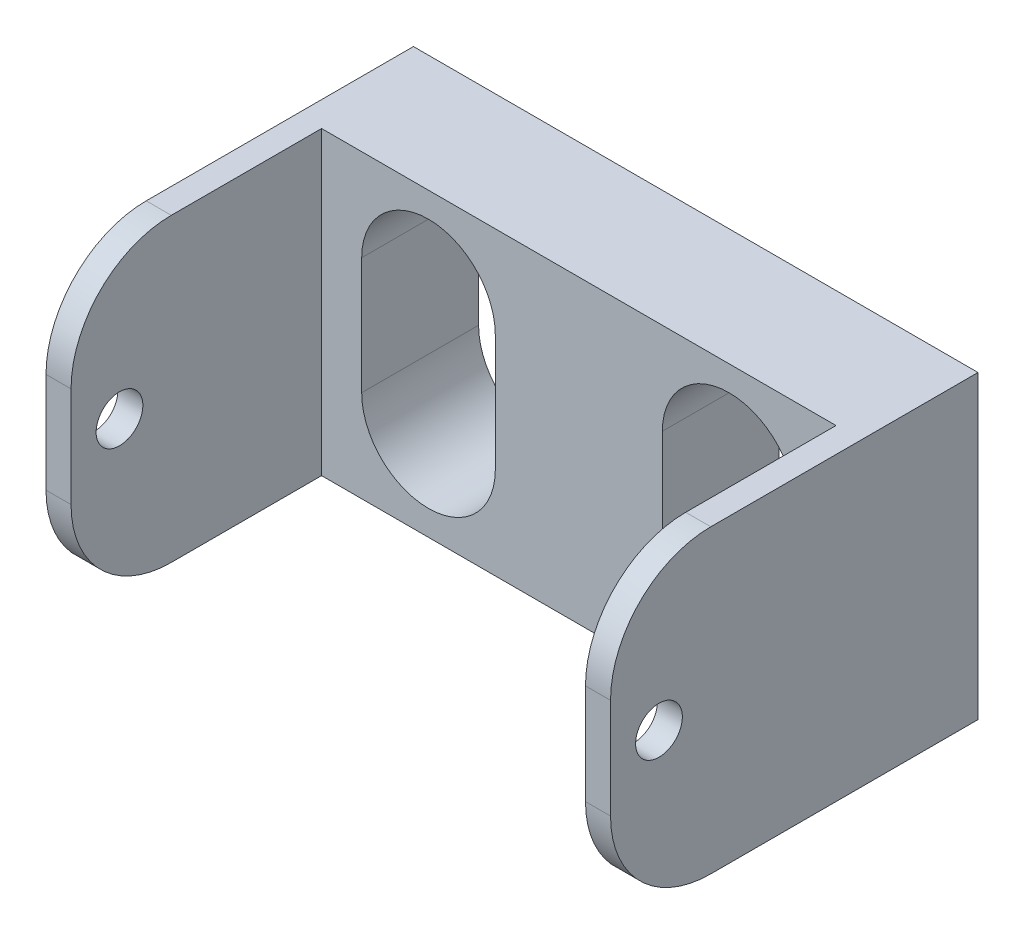
ISO-10303-21;
HEADER;
FILE_DESCRIPTION(('STEP AP214'),'2;1');
FILE_NAME('part.step','',(''),(''),'','','');
FILE_SCHEMA(('AUTOMOTIVE_DESIGN { 1 0 10303 214 1 1 1 1 }'));
ENDSEC;
DATA;
#1=APPLICATION_CONTEXT('core data for automotive mechanical design processes');
#2=APPLICATION_PROTOCOL_DEFINITION('international standard','automotive_design',2000,#1);
#3=PRODUCT_CONTEXT('',#1,'mechanical');
#4=PRODUCT('Part','Part','',(#3));
#5=PRODUCT_RELATED_PRODUCT_CATEGORY('part','',(#4));
#6=PRODUCT_DEFINITION_FORMATION('','',#4);
#7=PRODUCT_DEFINITION_CONTEXT('part definition',#1,'design');
#8=PRODUCT_DEFINITION('design','',#6,#7);
#9=PRODUCT_DEFINITION_SHAPE('','',#8);
#10=(LENGTH_UNIT() NAMED_UNIT(*) SI_UNIT(.MILLI.,.METRE.));
#11=(NAMED_UNIT(*) PLANE_ANGLE_UNIT() SI_UNIT($,.RADIAN.));
#12=(NAMED_UNIT(*) SI_UNIT($,.STERADIAN.) SOLID_ANGLE_UNIT());
#13=UNCERTAINTY_MEASURE_WITH_UNIT(LENGTH_MEASURE(1.E-05),#10,'distance_accuracy_value','');
#14=(GEOMETRIC_REPRESENTATION_CONTEXT(3) GLOBAL_UNCERTAINTY_ASSIGNED_CONTEXT((#13)) GLOBAL_UNIT_ASSIGNED_CONTEXT((#10,
#11,#12)) REPRESENTATION_CONTEXT('',''));
#15=CARTESIAN_POINT('',(0.,0.,0.));
#16=DIRECTION('',(0.,0.,1.));
#17=DIRECTION('',(1.,0.,0.));
#18=AXIS2_PLACEMENT_3D('',#15,#16,#17);
#19=CARTESIAN_POINT('',(0.,0.,7.));
#20=DIRECTION('',(0.,0.,-1.));
#21=DIRECTION('',(-1.,0.,0.));
#22=AXIS2_PLACEMENT_3D('',#19,#20,#21);
#23=PLANE('',#22);
#24=CARTESIAN_POINT('',(-9.,3.5,7.));
#25=DIRECTION('',(0.,0.,1.));
#26=DIRECTION('',(1.,0.,0.));
#27=AXIS2_PLACEMENT_3D('',#24,#25,#26);
#28=CIRCLE('',#27,4.);
#29=CARTESIAN_POINT('',(-5.,3.5,7.));
#30=VERTEX_POINT('',#29);
#31=CARTESIAN_POINT('',(-13.,3.5,7.));
#32=VERTEX_POINT('',#31);
#33=EDGE_CURVE('E242',#30,#32,#28,.T.);
#34=ORIENTED_EDGE('',*,*,#33,.F.);
#35=DIRECTION('',(0.,1.,0.));
#36=VECTOR('',#35,1.);
#37=CARTESIAN_POINT('',(-5.,3.5,7.));
#38=LINE('',#37,#36);
#39=CARTESIAN_POINT('',(-5.,-3.5,7.));
#40=VERTEX_POINT('',#39);
#41=EDGE_CURVE('E250',#40,#30,#38,.T.);
#42=ORIENTED_EDGE('',*,*,#41,.F.);
#43=CARTESIAN_POINT('',(-9.,-3.5,7.));
#44=DIRECTION('',(0.,0.,1.));
#45=DIRECTION('',(1.,0.,0.));
#46=AXIS2_PLACEMENT_3D('',#43,#44,#45);
#47=CIRCLE('',#46,4.);
#48=CARTESIAN_POINT('',(-13.,-3.5,7.));
#49=VERTEX_POINT('',#48);
#50=EDGE_CURVE('E247',#49,#40,#47,.T.);
#51=ORIENTED_EDGE('',*,*,#50,.F.);
#52=DIRECTION('',(0.,-1.,0.));
#53=VECTOR('',#52,1.);
#54=CARTESIAN_POINT('',(-13.,3.5,7.));
#55=LINE('',#54,#53);
#56=EDGE_CURVE('E244',#32,#49,#55,.T.);
#57=ORIENTED_EDGE('',*,*,#56,.F.);
#58=EDGE_LOOP('',(#34,#42,#51,#57));
#59=FACE_BOUND('',#58,.T.);
#60=CARTESIAN_POINT('',(9.,3.5,7.));
#61=DIRECTION('',(0.,0.,1.));
#62=DIRECTION('',(1.,0.,0.));
#63=AXIS2_PLACEMENT_3D('',#60,#61,#62);
#64=CIRCLE('',#63,4.);
#65=CARTESIAN_POINT('',(13.,3.5,7.));
#66=VERTEX_POINT('',#65);
#67=CARTESIAN_POINT('',(5.,3.5,7.));
#68=VERTEX_POINT('',#67);
#69=EDGE_CURVE('E210',#66,#68,#64,.T.);
#70=ORIENTED_EDGE('',*,*,#69,.F.);
#71=DIRECTION('',(0.,1.,0.));
#72=VECTOR('',#71,1.);
#73=CARTESIAN_POINT('',(13.,3.5,7.));
#74=LINE('',#73,#72);
#75=CARTESIAN_POINT('',(13.,-3.5,7.));
#76=VERTEX_POINT('',#75);
#77=EDGE_CURVE('E218',#76,#66,#74,.T.);
#78=ORIENTED_EDGE('',*,*,#77,.F.);
#79=CARTESIAN_POINT('',(9.,-3.5,7.));
#80=DIRECTION('',(0.,0.,1.));
#81=DIRECTION('',(1.,0.,0.));
#82=AXIS2_PLACEMENT_3D('',#79,#80,#81);
#83=CIRCLE('',#82,4.);
#84=CARTESIAN_POINT('',(5.,-3.5,7.));
#85=VERTEX_POINT('',#84);
#86=EDGE_CURVE('E215',#85,#76,#83,.T.);
#87=ORIENTED_EDGE('',*,*,#86,.F.);
#88=DIRECTION('',(0.,-1.,0.));
#89=VECTOR('',#88,1.);
#90=CARTESIAN_POINT('',(5.,3.5,7.));
#91=LINE('',#90,#89);
#92=EDGE_CURVE('E212',#68,#85,#91,.T.);
#93=ORIENTED_EDGE('',*,*,#92,.F.);
#94=EDGE_LOOP('',(#70,#78,#87,#93));
#95=FACE_BOUND('',#94,.T.);
#96=DIRECTION('',(0.,-1.,0.));
#97=VECTOR('',#96,1.);
#98=CARTESIAN_POINT('',(15.4,9.,7.));
#99=LINE('',#98,#97);
#100=CARTESIAN_POINT('',(15.4,9.,7.));
#101=VERTEX_POINT('',#100);
#102=CARTESIAN_POINT('',(15.4,-9.,7.));
#103=VERTEX_POINT('',#102);
#104=EDGE_CURVE('E186',#101,#103,#99,.T.);
#105=ORIENTED_EDGE('',*,*,#104,.F.);
#106=DIRECTION('',(-1.,0.,0.));
#107=VECTOR('',#106,1.);
#108=CARTESIAN_POINT('',(-16.9,9.,7.));
#109=LINE('',#108,#107);
#110=CARTESIAN_POINT('',(-15.4,9.,7.));
#111=VERTEX_POINT('',#110);
#112=EDGE_CURVE('E172',#101,#111,#109,.T.);
#113=ORIENTED_EDGE('',*,*,#112,.T.);
#114=DIRECTION('',(0.,1.,0.));
#115=VECTOR('',#114,1.);
#116=CARTESIAN_POINT('',(-15.4,9.,7.));
#117=LINE('',#116,#115);
#118=CARTESIAN_POINT('',(-15.4,-9.,7.));
#119=VERTEX_POINT('',#118);
#120=EDGE_CURVE('E183',#119,#111,#117,.T.);
#121=ORIENTED_EDGE('',*,*,#120,.F.);
#122=DIRECTION('',(1.,0.,0.));
#123=VECTOR('',#122,1.);
#124=CARTESIAN_POINT('',(-16.9,-9.,7.));
#125=LINE('',#124,#123);
#126=EDGE_CURVE('E187',#119,#103,#125,.T.);
#127=ORIENTED_EDGE('',*,*,#126,.T.);
#128=EDGE_LOOP('',(#105,#113,#121,#127));
#129=FACE_BOUND('',#128,.T.);
#130=ADVANCED_FACE('F35',(#59,#95,#129),#23,.F.);
#131=CARTESIAN_POINT('',(0.,0.,0.));
#132=DIRECTION('',(0.,0.,-1.));
#133=DIRECTION('',(-1.,0.,0.));
#134=AXIS2_PLACEMENT_3D('',#131,#132,#133);
#135=PLANE('',#134);
#136=DIRECTION('',(0.,1.,0.));
#137=VECTOR('',#136,1.);
#138=CARTESIAN_POINT('',(-5.,3.5,0.));
#139=LINE('',#138,#137);
#140=CARTESIAN_POINT('',(-5.,-3.5,0.));
#141=VERTEX_POINT('',#140);
#142=CARTESIAN_POINT('',(-5.,3.5,0.));
#143=VERTEX_POINT('',#142);
#144=EDGE_CURVE('E245',#141,#143,#139,.T.);
#145=ORIENTED_EDGE('',*,*,#144,.T.);
#146=CARTESIAN_POINT('',(-9.,3.5,0.));
#147=DIRECTION('',(0.,0.,1.));
#148=DIRECTION('',(1.,0.,0.));
#149=AXIS2_PLACEMENT_3D('',#146,#147,#148);
#150=CIRCLE('',#149,4.);
#151=CARTESIAN_POINT('',(-13.,3.5,0.));
#152=VERTEX_POINT('',#151);
#153=EDGE_CURVE('E241',#143,#152,#150,.T.);
#154=ORIENTED_EDGE('',*,*,#153,.T.);
#155=DIRECTION('',(0.,-1.,0.));
#156=VECTOR('',#155,1.);
#157=CARTESIAN_POINT('',(-13.,3.5,0.));
#158=LINE('',#157,#156);
#159=CARTESIAN_POINT('',(-13.,-3.5,0.));
#160=VERTEX_POINT('',#159);
#161=EDGE_CURVE('E255',#152,#160,#158,.T.);
#162=ORIENTED_EDGE('',*,*,#161,.T.);
#163=CARTESIAN_POINT('',(-9.,-3.5,0.));
#164=DIRECTION('',(0.,0.,1.));
#165=DIRECTION('',(1.,0.,0.));
#166=AXIS2_PLACEMENT_3D('',#163,#164,#165);
#167=CIRCLE('',#166,4.);
#168=EDGE_CURVE('E258',#160,#141,#167,.T.);
#169=ORIENTED_EDGE('',*,*,#168,.T.);
#170=EDGE_LOOP('',(#145,#154,#162,#169));
#171=FACE_BOUND('',#170,.T.);
#172=DIRECTION('',(0.,1.,0.));
#173=VECTOR('',#172,1.);
#174=CARTESIAN_POINT('',(16.9,-9.,0.));
#175=LINE('',#174,#173);
#176=CARTESIAN_POINT('',(16.9,-9.,0.));
#177=VERTEX_POINT('',#176);
#178=CARTESIAN_POINT('',(16.9,9.,0.));
#179=VERTEX_POINT('',#178);
#180=EDGE_CURVE('E272',#177,#179,#175,.T.);
#181=ORIENTED_EDGE('',*,*,#180,.F.);
#182=DIRECTION('',(1.,0.,0.));
#183=VECTOR('',#182,1.);
#184=CARTESIAN_POINT('',(-16.9,-9.,0.));
#185=LINE('',#184,#183);
#186=CARTESIAN_POINT('',(-16.9,-9.,0.));
#187=VERTEX_POINT('',#186);
#188=EDGE_CURVE('E188',#187,#177,#185,.T.);
#189=ORIENTED_EDGE('',*,*,#188,.F.);
#190=DIRECTION('',(0.,-1.,0.));
#191=VECTOR('',#190,1.);
#192=CARTESIAN_POINT('',(-16.9,-9.,0.));
#193=LINE('',#192,#191);
#194=CARTESIAN_POINT('',(-16.9,9.,0.));
#195=VERTEX_POINT('',#194);
#196=EDGE_CURVE('E425',#195,#187,#193,.T.);
#197=ORIENTED_EDGE('',*,*,#196,.F.);
#198=DIRECTION('',(-1.,0.,0.));
#199=VECTOR('',#198,1.);
#200=CARTESIAN_POINT('',(-16.9,9.,0.));
#201=LINE('',#200,#199);
#202=EDGE_CURVE('E427',#179,#195,#201,.T.);
#203=ORIENTED_EDGE('',*,*,#202,.F.);
#204=EDGE_LOOP('',(#181,#189,#197,#203));
#205=FACE_BOUND('',#204,.T.);
#206=DIRECTION('',(0.,1.,0.));
#207=VECTOR('',#206,1.);
#208=CARTESIAN_POINT('',(13.,3.5,0.));
#209=LINE('',#208,#207);
#210=CARTESIAN_POINT('',(13.,-3.5,0.));
#211=VERTEX_POINT('',#210);
#212=CARTESIAN_POINT('',(13.,3.5,0.));
#213=VERTEX_POINT('',#212);
#214=EDGE_CURVE('E213',#211,#213,#209,.T.);
#215=ORIENTED_EDGE('',*,*,#214,.T.);
#216=CARTESIAN_POINT('',(9.,3.5,0.));
#217=DIRECTION('',(0.,0.,1.));
#218=DIRECTION('',(1.,0.,0.));
#219=AXIS2_PLACEMENT_3D('',#216,#217,#218);
#220=CIRCLE('',#219,4.);
#221=CARTESIAN_POINT('',(5.,3.5,0.));
#222=VERTEX_POINT('',#221);
#223=EDGE_CURVE('E221',#213,#222,#220,.T.);
#224=ORIENTED_EDGE('',*,*,#223,.T.);
#225=DIRECTION('',(0.,-1.,0.));
#226=VECTOR('',#225,1.);
#227=CARTESIAN_POINT('',(5.,3.5,0.));
#228=LINE('',#227,#226);
#229=CARTESIAN_POINT('',(5.,-3.5,0.));
#230=VERTEX_POINT('',#229);
#231=EDGE_CURVE('E224',#222,#230,#228,.T.);
#232=ORIENTED_EDGE('',*,*,#231,.T.);
#233=CARTESIAN_POINT('',(9.,-3.5,0.));
#234=DIRECTION('',(0.,0.,1.));
#235=DIRECTION('',(1.,0.,0.));
#236=AXIS2_PLACEMENT_3D('',#233,#234,#235);
#237=CIRCLE('',#236,4.);
#238=EDGE_CURVE('E227',#230,#211,#237,.T.);
#239=ORIENTED_EDGE('',*,*,#238,.T.);
#240=EDGE_LOOP('',(#215,#224,#232,#239));
#241=FACE_BOUND('',#240,.T.);
#242=ADVANCED_FACE('F373',(#171,#205,#241),#135,.T.);
#243=CARTESIAN_POINT('',(16.9,-9.,7.));
#244=DIRECTION('',(-1.,0.,0.));
#245=DIRECTION('',(0.,0.,1.));
#246=AXIS2_PLACEMENT_3D('',#243,#244,#245);
#247=PLANE('',#246);
#248=CARTESIAN_POINT('',(16.9,0.,19.1));
#249=DIRECTION('',(1.,0.,0.));
#250=DIRECTION('',(0.,0.,-1.));
#251=AXIS2_PLACEMENT_3D('',#248,#249,#250);
#252=CIRCLE('',#251,1.4);
#253=CARTESIAN_POINT('',(16.9,0.,17.7));
#254=VERTEX_POINT('',#253);
#255=EDGE_CURVE('E349',#254,#254,#252,.T.);
#256=ORIENTED_EDGE('',*,*,#255,.F.);
#257=EDGE_LOOP('',(#256));
#258=FACE_BOUND('',#257,.T.);
#259=DIRECTION('',(0.,1.,0.));
#260=VECTOR('',#259,1.);
#261=CARTESIAN_POINT('',(16.9,9.,22.));
#262=LINE('',#261,#260);
#263=CARTESIAN_POINT('',(16.9,-3.,22.));
#264=VERTEX_POINT('',#263);
#265=CARTESIAN_POINT('',(16.9,3.,22.));
#266=VERTEX_POINT('',#265);
#267=EDGE_CURVE('E335',#264,#266,#262,.T.);
#268=ORIENTED_EDGE('',*,*,#267,.F.);
#269=CARTESIAN_POINT('',(16.9,-3.,16.));
#270=DIRECTION('',(-1.,0.,0.));
#271=DIRECTION('',(0.,0.,1.));
#272=AXIS2_PLACEMENT_3D('',#269,#270,#271);
#273=CIRCLE('',#272,6.);
#274=CARTESIAN_POINT('',(16.9,-9.,16.));
#275=VERTEX_POINT('',#274);
#276=EDGE_CURVE('E292',#264,#275,#273,.F.);
#277=ORIENTED_EDGE('',*,*,#276,.T.);
#278=DIRECTION('',(0.,0.,-1.));
#279=VECTOR('',#278,1.);
#280=CARTESIAN_POINT('',(16.9,-9.,7.));
#281=LINE('',#280,#279);
#282=EDGE_CURVE('E415',#275,#177,#281,.T.);
#283=ORIENTED_EDGE('',*,*,#282,.T.);
#284=ORIENTED_EDGE('',*,*,#180,.T.);
#285=DIRECTION('',(0.,0.,-1.));
#286=VECTOR('',#285,1.);
#287=CARTESIAN_POINT('',(16.9,9.,7.));
#288=LINE('',#287,#286);
#289=CARTESIAN_POINT('',(16.9,9.,16.));
#290=VERTEX_POINT('',#289);
#291=EDGE_CURVE('E287',#290,#179,#288,.T.);
#292=ORIENTED_EDGE('',*,*,#291,.F.);
#293=CARTESIAN_POINT('',(16.9,3.,16.));
#294=DIRECTION('',(-1.,0.,0.));
#295=DIRECTION('',(0.,0.,1.));
#296=AXIS2_PLACEMENT_3D('',#293,#294,#295);
#297=CIRCLE('',#296,6.);
#298=EDGE_CURVE('E290',#290,#266,#297,.F.);
#299=ORIENTED_EDGE('',*,*,#298,.T.);
#300=EDGE_LOOP('',(#268,#277,#283,#284,#292,#299));
#301=FACE_BOUND('',#300,.T.);
#302=ADVANCED_FACE('F324',(#258,#301),#247,.F.);
#303=CARTESIAN_POINT('',(-16.9,9.,7.));
#304=DIRECTION('',(0.,-1.,0.));
#305=DIRECTION('',(0.,0.,-1.));
#306=AXIS2_PLACEMENT_3D('',#303,#304,#305);
#307=PLANE('',#306);
#308=DIRECTION('',(0.,0.,-1.));
#309=VECTOR('',#308,1.);
#310=CARTESIAN_POINT('',(-16.9,9.,7.));
#311=LINE('',#310,#309);
#312=CARTESIAN_POINT('',(-16.9,9.,16.));
#313=VERTEX_POINT('',#312);
#314=EDGE_CURVE('E327',#313,#195,#311,.T.);
#315=ORIENTED_EDGE('',*,*,#314,.F.);
#316=DIRECTION('',(-1.,0.,0.));
#317=VECTOR('',#316,1.);
#318=CARTESIAN_POINT('',(-15.4,9.,16.));
#319=LINE('',#318,#317);
#320=CARTESIAN_POINT('',(-15.4,9.,16.));
#321=VERTEX_POINT('',#320);
#322=EDGE_CURVE('E11',#313,#321,#319,.F.);
#323=ORIENTED_EDGE('',*,*,#322,.T.);
#324=DIRECTION('',(0.,0.,-1.));
#325=VECTOR('',#324,1.);
#326=CARTESIAN_POINT('',(-15.4,9.,22.));
#327=LINE('',#326,#325);
#328=EDGE_CURVE('E168',#321,#111,#327,.T.);
#329=ORIENTED_EDGE('',*,*,#328,.T.);
#330=ORIENTED_EDGE('',*,*,#112,.F.);
#331=DIRECTION('',(0.,0.,-1.));
#332=VECTOR('',#331,1.);
#333=CARTESIAN_POINT('',(15.4,9.,22.));
#334=LINE('',#333,#332);
#335=CARTESIAN_POINT('',(15.4,9.,16.));
#336=VERTEX_POINT('',#335);
#337=EDGE_CURVE('E194',#336,#101,#334,.T.);
#338=ORIENTED_EDGE('',*,*,#337,.F.);
#339=DIRECTION('',(-1.,0.,0.));
#340=VECTOR('',#339,1.);
#341=CARTESIAN_POINT('',(-16.9,9.,16.));
#342=LINE('',#341,#340);
#343=EDGE_CURVE('E43',#336,#290,#342,.F.);
#344=ORIENTED_EDGE('',*,*,#343,.T.);
#345=ORIENTED_EDGE('',*,*,#291,.T.);
#346=ORIENTED_EDGE('',*,*,#202,.T.);
#347=EDGE_LOOP('',(#315,#323,#329,#330,#338,#344,#345,#346));
#348=FACE_BOUND('',#347,.T.);
#349=ADVANCED_FACE('F170',(#348),#307,.F.);
#350=CARTESIAN_POINT('',(-16.9,-9.,7.));
#351=DIRECTION('',(1.,0.,0.));
#352=DIRECTION('',(0.,0.,-1.));
#353=AXIS2_PLACEMENT_3D('',#350,#351,#352);
#354=PLANE('',#353);
#355=CARTESIAN_POINT('',(-16.9,0.,19.1));
#356=DIRECTION('',(1.,0.,0.));
#357=DIRECTION('',(0.,0.,-1.));
#358=AXIS2_PLACEMENT_3D('',#355,#356,#357);
#359=CIRCLE('',#358,1.4);
#360=CARTESIAN_POINT('',(-16.9,0.,17.7));
#361=VERTEX_POINT('',#360);
#362=EDGE_CURVE('E282',#361,#361,#359,.T.);
#363=ORIENTED_EDGE('',*,*,#362,.T.);
#364=EDGE_LOOP('',(#363));
#365=FACE_BOUND('',#364,.T.);
#366=DIRECTION('',(0.,0.,-1.));
#367=VECTOR('',#366,1.);
#368=CARTESIAN_POINT('',(-16.9,-9.,7.));
#369=LINE('',#368,#367);
#370=CARTESIAN_POINT('',(-16.9,-9.,16.));
#371=VERTEX_POINT('',#370);
#372=EDGE_CURVE('E416',#371,#187,#369,.T.);
#373=ORIENTED_EDGE('',*,*,#372,.F.);
#374=CARTESIAN_POINT('',(-16.9,-3.,16.));
#375=DIRECTION('',(1.,0.,0.));
#376=DIRECTION('',(0.,0.,-1.));
#377=AXIS2_PLACEMENT_3D('',#374,#375,#376);
#378=CIRCLE('',#377,6.);
#379=CARTESIAN_POINT('',(-16.9,-3.,22.));
#380=VERTEX_POINT('',#379);
#381=EDGE_CURVE('E314',#371,#380,#378,.F.);
#382=ORIENTED_EDGE('',*,*,#381,.T.);
#383=DIRECTION('',(0.,-1.,0.));
#384=VECTOR('',#383,1.);
#385=CARTESIAN_POINT('',(-16.9,9.,22.));
#386=LINE('',#385,#384);
#387=CARTESIAN_POINT('',(-16.9,3.,22.));
#388=VERTEX_POINT('',#387);
#389=EDGE_CURVE('E193',#388,#380,#386,.T.);
#390=ORIENTED_EDGE('',*,*,#389,.F.);
#391=CARTESIAN_POINT('',(-16.9,3.,16.));
#392=DIRECTION('',(1.,0.,0.));
#393=DIRECTION('',(0.,0.,-1.));
#394=AXIS2_PLACEMENT_3D('',#391,#392,#393);
#395=CIRCLE('',#394,6.);
#396=EDGE_CURVE('E50',#388,#313,#395,.F.);
#397=ORIENTED_EDGE('',*,*,#396,.T.);
#398=ORIENTED_EDGE('',*,*,#314,.T.);
#399=ORIENTED_EDGE('',*,*,#196,.T.);
#400=EDGE_LOOP('',(#373,#382,#390,#397,#398,#399));
#401=FACE_BOUND('',#400,.T.);
#402=ADVANCED_FACE('F355',(#365,#401),#354,.F.);
#403=CARTESIAN_POINT('',(-16.9,-9.,7.));
#404=DIRECTION('',(0.,1.,0.));
#405=DIRECTION('',(0.,0.,1.));
#406=AXIS2_PLACEMENT_3D('',#403,#404,#405);
#407=PLANE('',#406);
#408=ORIENTED_EDGE('',*,*,#282,.F.);
#409=DIRECTION('',(1.,0.,0.));
#410=VECTOR('',#409,1.);
#411=CARTESIAN_POINT('',(-16.9,-9.,16.));
#412=LINE('',#411,#410);
#413=CARTESIAN_POINT('',(15.4,-9.,16.));
#414=VERTEX_POINT('',#413);
#415=EDGE_CURVE('E297',#275,#414,#412,.F.);
#416=ORIENTED_EDGE('',*,*,#415,.T.);
#417=DIRECTION('',(0.,0.,-1.));
#418=VECTOR('',#417,1.);
#419=CARTESIAN_POINT('',(15.4,-9.,22.));
#420=LINE('',#419,#418);
#421=EDGE_CURVE('E198',#414,#103,#420,.T.);
#422=ORIENTED_EDGE('',*,*,#421,.T.);
#423=ORIENTED_EDGE('',*,*,#126,.F.);
#424=DIRECTION('',(0.,0.,-1.));
#425=VECTOR('',#424,1.);
#426=CARTESIAN_POINT('',(-15.4,-9.,22.));
#427=LINE('',#426,#425);
#428=CARTESIAN_POINT('',(-15.4,-9.,16.));
#429=VERTEX_POINT('',#428);
#430=EDGE_CURVE('E176',#429,#119,#427,.T.);
#431=ORIENTED_EDGE('',*,*,#430,.F.);
#432=DIRECTION('',(1.,0.,0.));
#433=VECTOR('',#432,1.);
#434=CARTESIAN_POINT('',(-16.9,-9.,16.));
#435=LINE('',#434,#433);
#436=EDGE_CURVE('E294',#429,#371,#435,.F.);
#437=ORIENTED_EDGE('',*,*,#436,.T.);
#438=ORIENTED_EDGE('',*,*,#372,.T.);
#439=ORIENTED_EDGE('',*,*,#188,.T.);
#440=EDGE_LOOP('',(#408,#416,#422,#423,#431,#437,#438,#439));
#441=FACE_BOUND('',#440,.T.);
#442=ADVANCED_FACE('F387',(#441),#407,.F.);
#443=CARTESIAN_POINT('',(-9.,3.5,7.));
#444=DIRECTION('',(0.,0.,-1.));
#445=DIRECTION('',(-1.,0.,0.));
#446=AXIS2_PLACEMENT_3D('',#443,#444,#445);
#447=CYLINDRICAL_SURFACE('',#446,4.);
#448=ORIENTED_EDGE('',*,*,#153,.F.);
#449=DIRECTION('',(0.,0.,-1.));
#450=VECTOR('',#449,1.);
#451=CARTESIAN_POINT('',(-5.,3.5,7.));
#452=LINE('',#451,#450);
#453=EDGE_CURVE('E252',#30,#143,#452,.T.);
#454=ORIENTED_EDGE('',*,*,#453,.F.);
#455=ORIENTED_EDGE('',*,*,#33,.T.);
#456=DIRECTION('',(0.,0.,-1.));
#457=VECTOR('',#456,1.);
#458=CARTESIAN_POINT('',(-13.,3.5,7.));
#459=LINE('',#458,#457);
#460=EDGE_CURVE('E269',#32,#152,#459,.T.);
#461=ORIENTED_EDGE('',*,*,#460,.T.);
#462=EDGE_LOOP('',(#448,#454,#455,#461));
#463=FACE_BOUND('',#462,.T.);
#464=ADVANCED_FACE('F384',(#463),#447,.F.);
#465=CARTESIAN_POINT('',(-13.,3.5,7.));
#466=DIRECTION('',(1.,0.,0.));
#467=DIRECTION('',(0.,1.,0.));
#468=AXIS2_PLACEMENT_3D('',#465,#466,#467);
#469=PLANE('',#468);
#470=ORIENTED_EDGE('',*,*,#161,.F.);
#471=ORIENTED_EDGE('',*,*,#460,.F.);
#472=ORIENTED_EDGE('',*,*,#56,.T.);
#473=DIRECTION('',(0.,0.,-1.));
#474=VECTOR('',#473,1.);
#475=CARTESIAN_POINT('',(-13.,-3.5,7.));
#476=LINE('',#475,#474);
#477=EDGE_CURVE('E267',#49,#160,#476,.T.);
#478=ORIENTED_EDGE('',*,*,#477,.T.);
#479=EDGE_LOOP('',(#470,#471,#472,#478));
#480=FACE_BOUND('',#479,.T.);
#481=ADVANCED_FACE('F467',(#480),#469,.T.);
#482=CARTESIAN_POINT('',(-9.,-3.5,7.));
#483=DIRECTION('',(0.,0.,-1.));
#484=DIRECTION('',(-1.,0.,0.));
#485=AXIS2_PLACEMENT_3D('',#482,#483,#484);
#486=CYLINDRICAL_SURFACE('',#485,4.);
#487=ORIENTED_EDGE('',*,*,#168,.F.);
#488=ORIENTED_EDGE('',*,*,#477,.F.);
#489=ORIENTED_EDGE('',*,*,#50,.T.);
#490=DIRECTION('',(0.,0.,-1.));
#491=VECTOR('',#490,1.);
#492=CARTESIAN_POINT('',(-5.,-3.5,7.));
#493=LINE('',#492,#491);
#494=EDGE_CURVE('E265',#40,#141,#493,.T.);
#495=ORIENTED_EDGE('',*,*,#494,.T.);
#496=EDGE_LOOP('',(#487,#488,#489,#495));
#497=FACE_BOUND('',#496,.T.);
#498=ADVANCED_FACE('F464',(#497),#486,.F.);
#499=CARTESIAN_POINT('',(-5.,3.5,7.));
#500=DIRECTION('',(-1.,0.,0.));
#501=DIRECTION('',(0.,0.,1.));
#502=AXIS2_PLACEMENT_3D('',#499,#500,#501);
#503=PLANE('',#502);
#504=ORIENTED_EDGE('',*,*,#144,.F.);
#505=ORIENTED_EDGE('',*,*,#494,.F.);
#506=ORIENTED_EDGE('',*,*,#41,.T.);
#507=ORIENTED_EDGE('',*,*,#453,.T.);
#508=EDGE_LOOP('',(#504,#505,#506,#507));
#509=FACE_BOUND('',#508,.T.);
#510=ADVANCED_FACE('F461',(#509),#503,.T.);
#511=CARTESIAN_POINT('',(9.,3.5,7.));
#512=DIRECTION('',(0.,0.,-1.));
#513=DIRECTION('',(-1.,0.,0.));
#514=AXIS2_PLACEMENT_3D('',#511,#512,#513);
#515=CYLINDRICAL_SURFACE('',#514,4.);
#516=ORIENTED_EDGE('',*,*,#223,.F.);
#517=DIRECTION('',(0.,0.,-1.));
#518=VECTOR('',#517,1.);
#519=CARTESIAN_POINT('',(13.,3.5,7.));
#520=LINE('',#519,#518);
#521=EDGE_CURVE('E220',#66,#213,#520,.T.);
#522=ORIENTED_EDGE('',*,*,#521,.F.);
#523=ORIENTED_EDGE('',*,*,#69,.T.);
#524=DIRECTION('',(0.,0.,-1.));
#525=VECTOR('',#524,1.);
#526=CARTESIAN_POINT('',(5.,3.5,7.));
#527=LINE('',#526,#525);
#528=EDGE_CURVE('E238',#68,#222,#527,.T.);
#529=ORIENTED_EDGE('',*,*,#528,.T.);
#530=EDGE_LOOP('',(#516,#522,#523,#529));
#531=FACE_BOUND('',#530,.T.);
#532=ADVANCED_FACE('F440',(#531),#515,.F.);
#533=CARTESIAN_POINT('',(5.,3.5,7.));
#534=DIRECTION('',(1.,0.,0.));
#535=DIRECTION('',(0.,1.,0.));
#536=AXIS2_PLACEMENT_3D('',#533,#534,#535);
#537=PLANE('',#536);
#538=ORIENTED_EDGE('',*,*,#231,.F.);
#539=ORIENTED_EDGE('',*,*,#528,.F.);
#540=ORIENTED_EDGE('',*,*,#92,.T.);
#541=DIRECTION('',(0.,0.,-1.));
#542=VECTOR('',#541,1.);
#543=CARTESIAN_POINT('',(5.,-3.5,7.));
#544=LINE('',#543,#542);
#545=EDGE_CURVE('E236',#85,#230,#544,.T.);
#546=ORIENTED_EDGE('',*,*,#545,.T.);
#547=EDGE_LOOP('',(#538,#539,#540,#546));
#548=FACE_BOUND('',#547,.T.);
#549=ADVANCED_FACE('F446',(#548),#537,.T.);
#550=CARTESIAN_POINT('',(9.,-3.5,7.));
#551=DIRECTION('',(0.,0.,-1.));
#552=DIRECTION('',(-1.,0.,0.));
#553=AXIS2_PLACEMENT_3D('',#550,#551,#552);
#554=CYLINDRICAL_SURFACE('',#553,4.);
#555=ORIENTED_EDGE('',*,*,#238,.F.);
#556=ORIENTED_EDGE('',*,*,#545,.F.);
#557=ORIENTED_EDGE('',*,*,#86,.T.);
#558=DIRECTION('',(0.,0.,-1.));
#559=VECTOR('',#558,1.);
#560=CARTESIAN_POINT('',(13.,-3.5,7.));
#561=LINE('',#560,#559);
#562=EDGE_CURVE('E234',#76,#211,#561,.T.);
#563=ORIENTED_EDGE('',*,*,#562,.T.);
#564=EDGE_LOOP('',(#555,#556,#557,#563));
#565=FACE_BOUND('',#564,.T.);
#566=ADVANCED_FACE('F448',(#565),#554,.F.);
#567=CARTESIAN_POINT('',(13.,3.5,7.));
#568=DIRECTION('',(-1.,0.,0.));
#569=DIRECTION('',(0.,-1.,0.));
#570=AXIS2_PLACEMENT_3D('',#567,#568,#569);
#571=PLANE('',#570);
#572=ORIENTED_EDGE('',*,*,#214,.F.);
#573=ORIENTED_EDGE('',*,*,#562,.F.);
#574=ORIENTED_EDGE('',*,*,#77,.T.);
#575=ORIENTED_EDGE('',*,*,#521,.T.);
#576=EDGE_LOOP('',(#572,#573,#574,#575));
#577=FACE_BOUND('',#576,.T.);
#578=ADVANCED_FACE('F435',(#577),#571,.T.);
#579=CARTESIAN_POINT('',(-15.4,9.,22.));
#580=DIRECTION('',(-1.,0.,0.));
#581=DIRECTION('',(0.,-1.,0.));
#582=AXIS2_PLACEMENT_3D('',#579,#580,#581);
#583=PLANE('',#582);
#584=CARTESIAN_POINT('',(-15.4,0.,19.1));
#585=DIRECTION('',(-1.,0.,0.));
#586=DIRECTION('',(0.,-1.,0.));
#587=AXIS2_PLACEMENT_3D('',#584,#585,#586);
#588=CIRCLE('',#587,1.4);
#589=CARTESIAN_POINT('',(-15.4,-1.4,19.1));
#590=VERTEX_POINT('',#589);
#591=EDGE_CURVE('E281',#590,#590,#588,.T.);
#592=ORIENTED_EDGE('',*,*,#591,.T.);
#593=EDGE_LOOP('',(#592));
#594=FACE_BOUND('',#593,.T.);
#595=DIRECTION('',(0.,1.,0.));
#596=VECTOR('',#595,1.);
#597=CARTESIAN_POINT('',(-15.4,9.,22.));
#598=LINE('',#597,#596);
#599=CARTESIAN_POINT('',(-15.4,-3.,22.));
#600=VERTEX_POINT('',#599);
#601=CARTESIAN_POINT('',(-15.4,3.,22.));
#602=VERTEX_POINT('',#601);
#603=EDGE_CURVE('E177',#600,#602,#598,.T.);
#604=ORIENTED_EDGE('',*,*,#603,.F.);
#605=CARTESIAN_POINT('',(-15.4,-3.,16.));
#606=DIRECTION('',(-1.,0.,0.));
#607=DIRECTION('',(0.,-1.,0.));
#608=AXIS2_PLACEMENT_3D('',#605,#606,#607);
#609=CIRCLE('',#608,6.);
#610=EDGE_CURVE('E311',#600,#429,#609,.F.);
#611=ORIENTED_EDGE('',*,*,#610,.T.);
#612=ORIENTED_EDGE('',*,*,#430,.T.);
#613=ORIENTED_EDGE('',*,*,#120,.T.);
#614=ORIENTED_EDGE('',*,*,#328,.F.);
#615=CARTESIAN_POINT('',(-15.4,3.,16.));
#616=DIRECTION('',(-1.,0.,0.));
#617=DIRECTION('',(0.,-1.,0.));
#618=AXIS2_PLACEMENT_3D('',#615,#616,#617);
#619=CIRCLE('',#618,6.);
#620=EDGE_CURVE('E308',#321,#602,#619,.F.);
#621=ORIENTED_EDGE('',*,*,#620,.T.);
#622=EDGE_LOOP('',(#604,#611,#612,#613,#614,#621));
#623=FACE_BOUND('',#622,.T.);
#624=ADVANCED_FACE('F191',(#594,#623),#583,.F.);
#625=CARTESIAN_POINT('',(0.,0.,22.));
#626=DIRECTION('',(0.,0.,1.));
#627=DIRECTION('',(1.,0.,0.));
#628=AXIS2_PLACEMENT_3D('',#625,#626,#627);
#629=PLANE('',#628);
#630=ORIENTED_EDGE('',*,*,#389,.T.);
#631=DIRECTION('',(1.,0.,0.));
#632=VECTOR('',#631,1.);
#633=CARTESIAN_POINT('',(-15.4,-3.,22.));
#634=LINE('',#633,#632);
#635=EDGE_CURVE('E306',#380,#600,#634,.T.);
#636=ORIENTED_EDGE('',*,*,#635,.T.);
#637=ORIENTED_EDGE('',*,*,#603,.T.);
#638=DIRECTION('',(-1.,0.,0.));
#639=VECTOR('',#638,1.);
#640=CARTESIAN_POINT('',(-16.9,3.,22.));
#641=LINE('',#640,#639);
#642=EDGE_CURVE('E303',#602,#388,#641,.T.);
#643=ORIENTED_EDGE('',*,*,#642,.T.);
#644=EDGE_LOOP('',(#630,#636,#637,#643));
#645=FACE_BOUND('',#644,.T.);
#646=ADVANCED_FACE('F409',(#645),#629,.T.);
#647=CARTESIAN_POINT('',(15.4,9.,22.));
#648=DIRECTION('',(1.,0.,0.));
#649=DIRECTION('',(0.,1.,0.));
#650=AXIS2_PLACEMENT_3D('',#647,#648,#649);
#651=PLANE('',#650);
#652=CARTESIAN_POINT('',(15.4,0.,19.1));
#653=DIRECTION('',(1.,0.,0.));
#654=DIRECTION('',(0.,1.,0.));
#655=AXIS2_PLACEMENT_3D('',#652,#653,#654);
#656=CIRCLE('',#655,1.4);
#657=CARTESIAN_POINT('',(15.4,1.4,19.1));
#658=VERTEX_POINT('',#657);
#659=EDGE_CURVE('E278',#658,#658,#656,.T.);
#660=ORIENTED_EDGE('',*,*,#659,.T.);
#661=EDGE_LOOP('',(#660));
#662=FACE_BOUND('',#661,.T.);
#663=ORIENTED_EDGE('',*,*,#421,.F.);
#664=CARTESIAN_POINT('',(15.4,-3.,16.));
#665=DIRECTION('',(1.,0.,0.));
#666=DIRECTION('',(0.,1.,0.));
#667=AXIS2_PLACEMENT_3D('',#664,#665,#666);
#668=CIRCLE('',#667,6.);
#669=CARTESIAN_POINT('',(15.4,-3.,22.));
#670=VERTEX_POINT('',#669);
#671=EDGE_CURVE('E301',#414,#670,#668,.F.);
#672=ORIENTED_EDGE('',*,*,#671,.T.);
#673=DIRECTION('',(0.,-1.,0.));
#674=VECTOR('',#673,1.);
#675=CARTESIAN_POINT('',(15.4,9.,22.));
#676=LINE('',#675,#674);
#677=CARTESIAN_POINT('',(15.4,3.,22.));
#678=VERTEX_POINT('',#677);
#679=EDGE_CURVE('E333',#678,#670,#676,.T.);
#680=ORIENTED_EDGE('',*,*,#679,.F.);
#681=CARTESIAN_POINT('',(15.4,3.,16.));
#682=DIRECTION('',(1.,0.,0.));
#683=DIRECTION('',(0.,1.,0.));
#684=AXIS2_PLACEMENT_3D('',#681,#682,#683);
#685=CIRCLE('',#684,6.);
#686=EDGE_CURVE('E299',#678,#336,#685,.F.);
#687=ORIENTED_EDGE('',*,*,#686,.T.);
#688=ORIENTED_EDGE('',*,*,#337,.T.);
#689=ORIENTED_EDGE('',*,*,#104,.T.);
#690=EDGE_LOOP('',(#663,#672,#680,#687,#688,#689));
#691=FACE_BOUND('',#690,.T.);
#692=ADVANCED_FACE('F338',(#662,#691),#651,.F.);
#693=CARTESIAN_POINT('',(0.,0.,22.));
#694=DIRECTION('',(0.,0.,-1.));
#695=DIRECTION('',(-1.,0.,0.));
#696=AXIS2_PLACEMENT_3D('',#693,#694,#695);
#697=PLANE('',#696);
#698=ORIENTED_EDGE('',*,*,#679,.T.);
#699=DIRECTION('',(1.,0.,0.));
#700=VECTOR('',#699,1.);
#701=CARTESIAN_POINT('',(0.,-3.,22.));
#702=LINE('',#701,#700);
#703=EDGE_CURVE('E286',#670,#264,#702,.T.);
#704=ORIENTED_EDGE('',*,*,#703,.T.);
#705=ORIENTED_EDGE('',*,*,#267,.T.);
#706=DIRECTION('',(-1.,0.,0.));
#707=VECTOR('',#706,1.);
#708=CARTESIAN_POINT('',(0.,3.,22.));
#709=LINE('',#708,#707);
#710=EDGE_CURVE('E283',#266,#678,#709,.T.);
#711=ORIENTED_EDGE('',*,*,#710,.T.);
#712=EDGE_LOOP('',(#698,#704,#705,#711));
#713=FACE_BOUND('',#712,.T.);
#714=ADVANCED_FACE('F332',(#713),#697,.F.);
#715=CARTESIAN_POINT('',(-16.9,0.,19.1));
#716=DIRECTION('',(1.,0.,0.));
#717=DIRECTION('',(0.,0.,-1.));
#718=AXIS2_PLACEMENT_3D('',#715,#716,#717);
#719=CYLINDRICAL_SURFACE('',#718,1.4);
#720=ORIENTED_EDGE('',*,*,#255,.T.);
#721=EDGE_LOOP('',(#720));
#722=FACE_BOUND('',#721,.T.);
#723=ORIENTED_EDGE('',*,*,#659,.F.);
#724=EDGE_LOOP('',(#723));
#725=FACE_BOUND('',#724,.T.);
#726=ADVANCED_FACE('F361',(#722,#725),#719,.F.);
#727=ORIENTED_EDGE('',*,*,#362,.F.);
#728=EDGE_LOOP('',(#727));
#729=FACE_BOUND('',#728,.T.);
#730=ORIENTED_EDGE('',*,*,#591,.F.);
#731=EDGE_LOOP('',(#730));
#732=FACE_BOUND('',#731,.T.);
#733=ADVANCED_FACE('F357',(#729,#732),#719,.F.);
#734=CARTESIAN_POINT('',(0.,-3.,16.));
#735=DIRECTION('',(1.,0.,0.));
#736=DIRECTION('',(0.,0.,-1.));
#737=AXIS2_PLACEMENT_3D('',#734,#735,#736);
#738=CYLINDRICAL_SURFACE('',#737,6.);
#739=ORIENTED_EDGE('',*,*,#671,.F.);
#740=ORIENTED_EDGE('',*,*,#415,.F.);
#741=ORIENTED_EDGE('',*,*,#276,.F.);
#742=ORIENTED_EDGE('',*,*,#703,.F.);
#743=EDGE_LOOP('',(#739,#740,#741,#742));
#744=FACE_BOUND('',#743,.T.);
#745=ADVANCED_FACE('F360',(#744),#738,.T.);
#746=CARTESIAN_POINT('',(0.,-3.,16.));
#747=DIRECTION('',(-1.,0.,0.));
#748=DIRECTION('',(0.,0.,1.));
#749=AXIS2_PLACEMENT_3D('',#746,#747,#748);
#750=CYLINDRICAL_SURFACE('',#749,6.);
#751=ORIENTED_EDGE('',*,*,#381,.F.);
#752=ORIENTED_EDGE('',*,*,#436,.F.);
#753=ORIENTED_EDGE('',*,*,#610,.F.);
#754=ORIENTED_EDGE('',*,*,#635,.F.);
#755=EDGE_LOOP('',(#751,#752,#753,#754));
#756=FACE_BOUND('',#755,.T.);
#757=ADVANCED_FACE('F367',(#756),#750,.T.);
#758=CARTESIAN_POINT('',(0.,3.,16.));
#759=DIRECTION('',(1.,0.,0.));
#760=DIRECTION('',(0.,0.,-1.));
#761=AXIS2_PLACEMENT_3D('',#758,#759,#760);
#762=CYLINDRICAL_SURFACE('',#761,6.);
#763=ORIENTED_EDGE('',*,*,#620,.F.);
#764=ORIENTED_EDGE('',*,*,#322,.F.);
#765=ORIENTED_EDGE('',*,*,#396,.F.);
#766=ORIENTED_EDGE('',*,*,#642,.F.);
#767=EDGE_LOOP('',(#763,#764,#765,#766));
#768=FACE_BOUND('',#767,.T.);
#769=ADVANCED_FACE('F399',(#768),#762,.T.);
#770=CARTESIAN_POINT('',(0.,3.,16.));
#771=DIRECTION('',(-1.,0.,0.));
#772=DIRECTION('',(0.,0.,1.));
#773=AXIS2_PLACEMENT_3D('',#770,#771,#772);
#774=CYLINDRICAL_SURFACE('',#773,6.);
#775=ORIENTED_EDGE('',*,*,#298,.F.);
#776=ORIENTED_EDGE('',*,*,#343,.F.);
#777=ORIENTED_EDGE('',*,*,#686,.F.);
#778=ORIENTED_EDGE('',*,*,#710,.F.);
#779=EDGE_LOOP('',(#775,#776,#777,#778));
#780=FACE_BOUND('',#779,.T.);
#781=ADVANCED_FACE('F37',(#780),#774,.T.);
#782=CLOSED_SHELL('',(#130,#242,#302,#349,#402,#442,#464,#481,#498,#510,#532,#549,#566,#578,
#624,#646,#692,#714,#726,#733,#745,#757,#769,#781));
#783=MANIFOLD_SOLID_BREP('B2',#782);
#784=ADVANCED_BREP_SHAPE_REPRESENTATION('',(#18,#783),#14);
#785=SHAPE_DEFINITION_REPRESENTATION(#9,#784);
ENDSEC;
END-ISO-10303-21;
